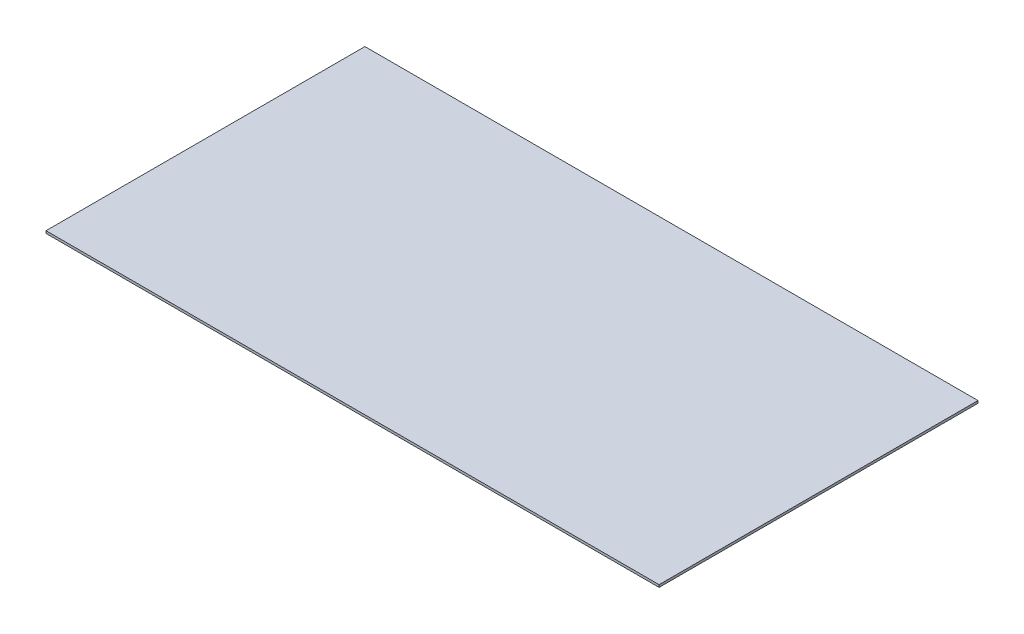
ISO-10303-21;
HEADER;
FILE_DESCRIPTION(('STEP AP214'),'2;1');
FILE_NAME('part.step','',(''),(''),'','','');
FILE_SCHEMA(('AUTOMOTIVE_DESIGN { 1 0 10303 214 1 1 1 1 }'));
ENDSEC;
DATA;
#1=APPLICATION_CONTEXT('core data for automotive mechanical design processes');
#2=APPLICATION_PROTOCOL_DEFINITION('international standard','automotive_design',2000,#1);
#3=PRODUCT_CONTEXT('',#1,'mechanical');
#4=PRODUCT('Part','Part','',(#3));
#5=PRODUCT_RELATED_PRODUCT_CATEGORY('part','',(#4));
#6=PRODUCT_DEFINITION_FORMATION('','',#4);
#7=PRODUCT_DEFINITION_CONTEXT('part definition',#1,'design');
#8=PRODUCT_DEFINITION('design','',#6,#7);
#9=PRODUCT_DEFINITION_SHAPE('','',#8);
#10=(LENGTH_UNIT() NAMED_UNIT(*) SI_UNIT(.MILLI.,.METRE.));
#11=(NAMED_UNIT(*) PLANE_ANGLE_UNIT() SI_UNIT($,.RADIAN.));
#12=(NAMED_UNIT(*) SI_UNIT($,.STERADIAN.) SOLID_ANGLE_UNIT());
#13=UNCERTAINTY_MEASURE_WITH_UNIT(LENGTH_MEASURE(1.E-05),#10,'distance_accuracy_value','');
#14=(GEOMETRIC_REPRESENTATION_CONTEXT(3) GLOBAL_UNCERTAINTY_ASSIGNED_CONTEXT((#13)) GLOBAL_UNIT_ASSIGNED_CONTEXT((#10,
#11,#12)) REPRESENTATION_CONTEXT('',''));
#15=CARTESIAN_POINT('',(0.,0.,0.));
#16=DIRECTION('',(0.,0.,1.));
#17=DIRECTION('',(1.,0.,0.));
#18=AXIS2_PLACEMENT_3D('',#15,#16,#17);
#19=CARTESIAN_POINT('',(38.45,0.3,-20.));
#20=DIRECTION('',(-1.,0.,0.));
#21=DIRECTION('',(0.,0.,1.));
#22=AXIS2_PLACEMENT_3D('',#19,#20,#21);
#23=PLANE('',#22);
#24=DIRECTION('',(0.,0.,-1.));
#25=VECTOR('',#24,1.);
#26=CARTESIAN_POINT('',(38.45,0.,-20.));
#27=LINE('',#26,#25);
#28=CARTESIAN_POINT('',(38.45,0.,20.));
#29=VERTEX_POINT('',#28);
#30=CARTESIAN_POINT('',(38.45,0.,-20.));
#31=VERTEX_POINT('',#30);
#32=EDGE_CURVE('E121',#29,#31,#27,.T.);
#33=ORIENTED_EDGE('',*,*,#32,.T.);
#34=DIRECTION('',(0.,-1.,0.));
#35=VECTOR('',#34,1.);
#36=CARTESIAN_POINT('',(38.45,0.3,-20.));
#37=LINE('',#36,#35);
#38=CARTESIAN_POINT('',(38.45,0.3,-20.));
#39=VERTEX_POINT('',#38);
#40=EDGE_CURVE('E11',#39,#31,#37,.T.);
#41=ORIENTED_EDGE('',*,*,#40,.F.);
#42=DIRECTION('',(0.,0.,-1.));
#43=VECTOR('',#42,1.);
#44=CARTESIAN_POINT('',(38.45,0.3,-20.));
#45=LINE('',#44,#43);
#46=CARTESIAN_POINT('',(38.45,0.3,20.));
#47=VERTEX_POINT('',#46);
#48=EDGE_CURVE('E104',#47,#39,#45,.T.);
#49=ORIENTED_EDGE('',*,*,#48,.F.);
#50=DIRECTION('',(0.,-1.,0.));
#51=VECTOR('',#50,1.);
#52=CARTESIAN_POINT('',(38.45,0.3,20.));
#53=LINE('',#52,#51);
#54=EDGE_CURVE('E117',#47,#29,#53,.T.);
#55=ORIENTED_EDGE('',*,*,#54,.T.);
#56=EDGE_LOOP('',(#33,#41,#49,#55));
#57=FACE_BOUND('',#56,.T.);
#58=ADVANCED_FACE('F44',(#57),#23,.F.);
#59=CARTESIAN_POINT('',(-38.45,0.3,-20.));
#60=DIRECTION('',(0.,0.,1.));
#61=DIRECTION('',(1.,0.,0.));
#62=AXIS2_PLACEMENT_3D('',#59,#60,#61);
#63=PLANE('',#62);
#64=DIRECTION('',(-1.,0.,0.));
#65=VECTOR('',#64,1.);
#66=CARTESIAN_POINT('',(-38.45,0.,-20.));
#67=LINE('',#66,#65);
#68=CARTESIAN_POINT('',(-38.45,0.,-20.));
#69=VERTEX_POINT('',#68);
#70=EDGE_CURVE('E109',#31,#69,#67,.T.);
#71=ORIENTED_EDGE('',*,*,#70,.T.);
#72=DIRECTION('',(0.,-1.,0.));
#73=VECTOR('',#72,1.);
#74=CARTESIAN_POINT('',(-38.45,0.3,-20.));
#75=LINE('',#74,#73);
#76=CARTESIAN_POINT('',(-38.45,0.3,-20.));
#77=VERTEX_POINT('',#76);
#78=EDGE_CURVE('E53',#77,#69,#75,.T.);
#79=ORIENTED_EDGE('',*,*,#78,.F.);
#80=DIRECTION('',(-1.,0.,0.));
#81=VECTOR('',#80,1.);
#82=CARTESIAN_POINT('',(-38.45,0.3,-20.));
#83=LINE('',#82,#81);
#84=EDGE_CURVE('E98',#39,#77,#83,.T.);
#85=ORIENTED_EDGE('',*,*,#84,.F.);
#86=ORIENTED_EDGE('',*,*,#40,.T.);
#87=EDGE_LOOP('',(#71,#79,#85,#86));
#88=FACE_BOUND('',#87,.T.);
#89=ADVANCED_FACE('F108',(#88),#63,.F.);
#90=CARTESIAN_POINT('',(-38.45,0.3,-20.));
#91=DIRECTION('',(1.,0.,0.));
#92=DIRECTION('',(0.,0.,-1.));
#93=AXIS2_PLACEMENT_3D('',#90,#91,#92);
#94=PLANE('',#93);
#95=DIRECTION('',(0.,0.,1.));
#96=VECTOR('',#95,1.);
#97=CARTESIAN_POINT('',(-38.45,0.,-20.));
#98=LINE('',#97,#96);
#99=CARTESIAN_POINT('',(-38.45,0.,20.));
#100=VERTEX_POINT('',#99);
#101=EDGE_CURVE('E84',#69,#100,#98,.T.);
#102=ORIENTED_EDGE('',*,*,#101,.T.);
#103=DIRECTION('',(0.,-1.,0.));
#104=VECTOR('',#103,1.);
#105=CARTESIAN_POINT('',(-38.45,0.3,20.));
#106=LINE('',#105,#104);
#107=CARTESIAN_POINT('',(-38.45,0.3,20.));
#108=VERTEX_POINT('',#107);
#109=EDGE_CURVE('E111',#108,#100,#106,.T.);
#110=ORIENTED_EDGE('',*,*,#109,.F.);
#111=DIRECTION('',(0.,0.,1.));
#112=VECTOR('',#111,1.);
#113=CARTESIAN_POINT('',(-38.45,0.3,-20.));
#114=LINE('',#113,#112);
#115=EDGE_CURVE('E102',#77,#108,#114,.T.);
#116=ORIENTED_EDGE('',*,*,#115,.F.);
#117=ORIENTED_EDGE('',*,*,#78,.T.);
#118=EDGE_LOOP('',(#102,#110,#116,#117));
#119=FACE_BOUND('',#118,.T.);
#120=ADVANCED_FACE('F112',(#119),#94,.F.);
#121=CARTESIAN_POINT('',(-38.45,0.3,20.));
#122=DIRECTION('',(0.,0.,-1.));
#123=DIRECTION('',(-1.,0.,0.));
#124=AXIS2_PLACEMENT_3D('',#121,#122,#123);
#125=PLANE('',#124);
#126=DIRECTION('',(1.,0.,0.));
#127=VECTOR('',#126,1.);
#128=CARTESIAN_POINT('',(-38.45,0.,20.));
#129=LINE('',#128,#127);
#130=EDGE_CURVE('E90',#100,#29,#129,.T.);
#131=ORIENTED_EDGE('',*,*,#130,.T.);
#132=ORIENTED_EDGE('',*,*,#54,.F.);
#133=DIRECTION('',(1.,0.,0.));
#134=VECTOR('',#133,1.);
#135=CARTESIAN_POINT('',(-38.45,0.3,20.));
#136=LINE('',#135,#134);
#137=EDGE_CURVE('E64',#108,#47,#136,.T.);
#138=ORIENTED_EDGE('',*,*,#137,.F.);
#139=ORIENTED_EDGE('',*,*,#109,.T.);
#140=EDGE_LOOP('',(#131,#132,#138,#139));
#141=FACE_BOUND('',#140,.T.);
#142=ADVANCED_FACE('F133',(#141),#125,.F.);
#143=CARTESIAN_POINT('',(38.45,0.3,20.));
#144=DIRECTION('',(0.,1.,0.));
#145=DIRECTION('',(0.,0.,1.));
#146=AXIS2_PLACEMENT_3D('',#143,#144,#145);
#147=PLANE('',#146);
#148=ORIENTED_EDGE('',*,*,#48,.T.);
#149=ORIENTED_EDGE('',*,*,#84,.T.);
#150=ORIENTED_EDGE('',*,*,#115,.T.);
#151=ORIENTED_EDGE('',*,*,#137,.T.);
#152=EDGE_LOOP('',(#148,#149,#150,#151));
#153=FACE_BOUND('',#152,.T.);
#154=ADVANCED_FACE('F100',(#153),#147,.T.);
#155=CARTESIAN_POINT('',(38.45,0.,20.));
#156=DIRECTION('',(0.,1.,0.));
#157=DIRECTION('',(0.,0.,1.));
#158=AXIS2_PLACEMENT_3D('',#155,#156,#157);
#159=PLANE('',#158);
#160=ORIENTED_EDGE('',*,*,#32,.F.);
#161=ORIENTED_EDGE('',*,*,#130,.F.);
#162=ORIENTED_EDGE('',*,*,#101,.F.);
#163=ORIENTED_EDGE('',*,*,#70,.F.);
#164=EDGE_LOOP('',(#160,#161,#162,#163));
#165=FACE_BOUND('',#164,.T.);
#166=ADVANCED_FACE('F136',(#165),#159,.F.);
#167=CLOSED_SHELL('',(#58,#89,#120,#142,#154,#166));
#168=MANIFOLD_SOLID_BREP('B2',#167);
#169=ADVANCED_BREP_SHAPE_REPRESENTATION('',(#18,#168),#14);
#170=SHAPE_DEFINITION_REPRESENTATION(#9,#169);
ENDSEC;
END-ISO-10303-21;
